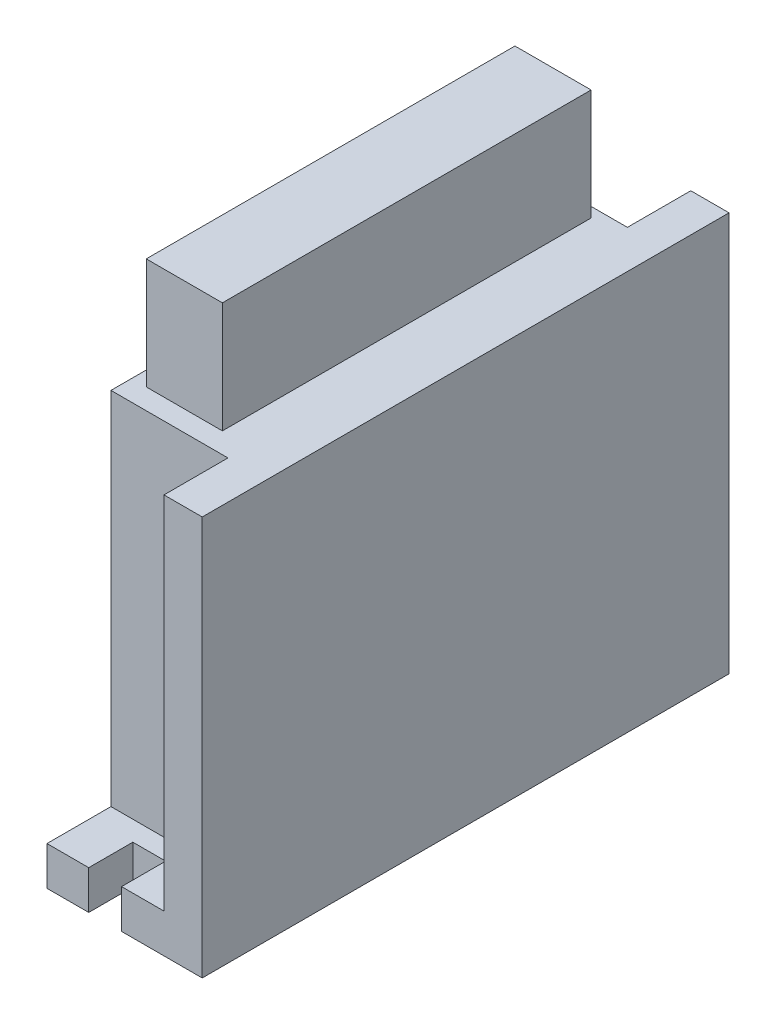
ISO-10303-21;
HEADER;
FILE_DESCRIPTION(('STEP AP214'),'2;1');
FILE_NAME('part.step','',(''),(''),'','','');
FILE_SCHEMA(('AUTOMOTIVE_DESIGN { 1 0 10303 214 1 1 1 1 }'));
ENDSEC;
DATA;
#1=APPLICATION_CONTEXT('core data for automotive mechanical design processes');
#2=APPLICATION_PROTOCOL_DEFINITION('international standard','automotive_design',2000,#1);
#3=PRODUCT_CONTEXT('',#1,'mechanical');
#4=PRODUCT('Part','Part','',(#3));
#5=PRODUCT_RELATED_PRODUCT_CATEGORY('part','',(#4));
#6=PRODUCT_DEFINITION_FORMATION('','',#4);
#7=PRODUCT_DEFINITION_CONTEXT('part definition',#1,'design');
#8=PRODUCT_DEFINITION('design','',#6,#7);
#9=PRODUCT_DEFINITION_SHAPE('','',#8);
#10=(LENGTH_UNIT() NAMED_UNIT(*) SI_UNIT(.MILLI.,.METRE.));
#11=(NAMED_UNIT(*) PLANE_ANGLE_UNIT() SI_UNIT($,.RADIAN.));
#12=(NAMED_UNIT(*) SI_UNIT($,.STERADIAN.) SOLID_ANGLE_UNIT());
#13=UNCERTAINTY_MEASURE_WITH_UNIT(LENGTH_MEASURE(1.E-05),#10,'distance_accuracy_value','');
#14=(GEOMETRIC_REPRESENTATION_CONTEXT(3) GLOBAL_UNCERTAINTY_ASSIGNED_CONTEXT((#13)) GLOBAL_UNIT_ASSIGNED_CONTEXT((#10,
#11,#12)) REPRESENTATION_CONTEXT('',''));
#15=CARTESIAN_POINT('',(0.,0.,0.));
#16=DIRECTION('',(0.,0.,1.));
#17=DIRECTION('',(1.,0.,0.));
#18=AXIS2_PLACEMENT_3D('',#15,#16,#17);
#19=CARTESIAN_POINT('',(-8.85412667946256,72.,51.3291746641075));
#20=DIRECTION('',(0.,0.,-1.));
#21=DIRECTION('',(-1.,0.,0.));
#22=AXIS2_PLACEMENT_3D('',#19,#20,#21);
#23=PLANE('',#22);
#24=DIRECTION('',(1.,0.,0.));
#25=VECTOR('',#24,1.);
#26=CARTESIAN_POINT('',(-8.85412667946256,0.,51.3291746641075));
#27=LINE('',#26,#25);
#28=CARTESIAN_POINT('',(-8.85412667946256,0.,51.3291746641075));
#29=VERTEX_POINT('',#28);
#30=CARTESIAN_POINT('',(-1.3231264849736,0.,51.3291746641075));
#31=VERTEX_POINT('',#30);
#32=EDGE_CURVE('E215',#29,#31,#27,.T.);
#33=ORIENTED_EDGE('',*,*,#32,.T.);
#34=DIRECTION('',(0.,1.,0.));
#35=VECTOR('',#34,1.);
#36=CARTESIAN_POINT('',(-1.3231264849736,-58.,51.3291746641075));
#37=LINE('',#36,#35);
#38=CARTESIAN_POINT('',(-1.3231264849736,6.99999999999998,51.3291746641075));
#39=VERTEX_POINT('',#38);
#40=EDGE_CURVE('E198',#31,#39,#37,.T.);
#41=ORIENTED_EDGE('',*,*,#40,.T.);
#42=DIRECTION('',(1.,0.,0.));
#43=VECTOR('',#42,1.);
#44=CARTESIAN_POINT('',(-8.85412667946256,6.99999999999998,51.3291746641075));
#45=LINE('',#44,#43);
#46=CARTESIAN_POINT('',(-8.85412667946256,6.99999999999998,51.3291746641075));
#47=VERTEX_POINT('',#46);
#48=EDGE_CURVE('E212',#47,#39,#45,.T.);
#49=ORIENTED_EDGE('',*,*,#48,.F.);
#50=DIRECTION('',(0.,-1.,0.));
#51=VECTOR('',#50,1.);
#52=CARTESIAN_POINT('',(-8.85412667946256,72.,51.3291746641075));
#53=LINE('',#52,#51);
#54=EDGE_CURVE('E11',#47,#29,#53,.T.);
#55=ORIENTED_EDGE('',*,*,#54,.T.);
#56=EDGE_LOOP('',(#33,#41,#49,#55));
#57=FACE_BOUND('',#56,.T.);
#58=ADVANCED_FACE('F45',(#57),#23,.F.);
#59=CARTESIAN_POINT('',(-8.85412667946257,72.,-43.6708253358925));
#60=DIRECTION('',(0.,0.,1.));
#61=DIRECTION('',(1.,0.,0.));
#62=AXIS2_PLACEMENT_3D('',#59,#60,#61);
#63=PLANE('',#62);
#64=DIRECTION('',(-1.,0.,0.));
#65=VECTOR('',#64,1.);
#66=CARTESIAN_POINT('',(-8.85412667946257,6.99999999999998,-43.6708253358925));
#67=LINE('',#66,#65);
#68=CARTESIAN_POINT('',(-1.3231264849736,6.99999999999998,-43.6708253358925));
#69=VERTEX_POINT('',#68);
#70=CARTESIAN_POINT('',(-8.85412667946257,6.99999999999998,-43.6708253358925));
#71=VERTEX_POINT('',#70);
#72=EDGE_CURVE('E259',#69,#71,#67,.T.);
#73=ORIENTED_EDGE('',*,*,#72,.F.);
#74=DIRECTION('',(0.,1.,0.));
#75=VECTOR('',#74,1.);
#76=CARTESIAN_POINT('',(-1.3231264849736,-58.,-43.6708253358925));
#77=LINE('',#76,#75);
#78=CARTESIAN_POINT('',(-1.3231264849736,0.,-43.6708253358925));
#79=VERTEX_POINT('',#78);
#80=EDGE_CURVE('E423',#79,#69,#77,.T.);
#81=ORIENTED_EDGE('',*,*,#80,.F.);
#82=DIRECTION('',(-1.,0.,0.));
#83=VECTOR('',#82,1.);
#84=CARTESIAN_POINT('',(-8.85412667946257,0.,-43.6708253358925));
#85=LINE('',#84,#83);
#86=CARTESIAN_POINT('',(-8.85412667946257,0.,-43.6708253358925));
#87=VERTEX_POINT('',#86);
#88=EDGE_CURVE('E357',#79,#87,#85,.T.);
#89=ORIENTED_EDGE('',*,*,#88,.T.);
#90=DIRECTION('',(0.,-1.,0.));
#91=VECTOR('',#90,1.);
#92=CARTESIAN_POINT('',(-8.85412667946257,72.,-43.6708253358925));
#93=LINE('',#92,#91);
#94=EDGE_CURVE('E347',#71,#87,#93,.T.);
#95=ORIENTED_EDGE('',*,*,#94,.F.);
#96=EDGE_LOOP('',(#73,#81,#89,#95));
#97=FACE_BOUND('',#96,.T.);
#98=ADVANCED_FACE('F420',(#97),#63,.F.);
#99=CARTESIAN_POINT('',(-8.85412667946257,72.,-43.6708253358925));
#100=DIRECTION('',(1.,0.,0.));
#101=DIRECTION('',(0.,0.,-1.));
#102=AXIS2_PLACEMENT_3D('',#99,#100,#101);
#103=PLANE('',#102);
#104=DIRECTION('',(0.,0.,1.));
#105=VECTOR('',#104,1.);
#106=CARTESIAN_POINT('',(-8.85412667946256,6.99999999999998,51.3291746641075));
#107=LINE('',#106,#105);
#108=CARTESIAN_POINT('',(-8.85412667946256,6.99999999999998,39.789202994742));
#109=VERTEX_POINT('',#108);
#110=EDGE_CURVE('E222',#109,#47,#107,.T.);
#111=ORIENTED_EDGE('',*,*,#110,.F.);
#112=DIRECTION('',(0.,1.,0.));
#113=VECTOR('',#112,1.);
#114=CARTESIAN_POINT('',(-8.85412667946256,6.99999999999998,39.789202994742));
#115=LINE('',#114,#113);
#116=CARTESIAN_POINT('',(-8.85412667946256,72.,39.789202994742));
#117=VERTEX_POINT('',#116);
#118=EDGE_CURVE('E246',#109,#117,#115,.T.);
#119=ORIENTED_EDGE('',*,*,#118,.T.);
#120=DIRECTION('',(0.,0.,1.));
#121=VECTOR('',#120,1.);
#122=CARTESIAN_POINT('',(-8.85412667946257,72.,-43.6708253358925));
#123=LINE('',#122,#121);
#124=CARTESIAN_POINT('',(-8.85412667946257,72.,-32.2364925855632));
#125=VERTEX_POINT('',#124);
#126=EDGE_CURVE('E332',#125,#117,#123,.T.);
#127=ORIENTED_EDGE('',*,*,#126,.F.);
#128=DIRECTION('',(0.,1.,0.));
#129=VECTOR('',#128,1.);
#130=CARTESIAN_POINT('',(-8.85412667946257,6.99999999999998,-32.2364925855632));
#131=LINE('',#130,#129);
#132=CARTESIAN_POINT('',(-8.85412667946257,6.99999999999998,-32.2364925855632));
#133=VERTEX_POINT('',#132);
#134=EDGE_CURVE('E256',#133,#125,#131,.T.);
#135=ORIENTED_EDGE('',*,*,#134,.F.);
#136=DIRECTION('',(0.,0.,1.));
#137=VECTOR('',#136,1.);
#138=CARTESIAN_POINT('',(-8.85412667946257,6.99999999999998,-43.6708253358925));
#139=LINE('',#138,#137);
#140=EDGE_CURVE('E271',#71,#133,#139,.T.);
#141=ORIENTED_EDGE('',*,*,#140,.F.);
#142=ORIENTED_EDGE('',*,*,#94,.T.);
#143=DIRECTION('',(0.,0.,1.));
#144=VECTOR('',#143,1.);
#145=CARTESIAN_POINT('',(-8.85412667946257,0.,-43.6708253358925));
#146=LINE('',#145,#144);
#147=EDGE_CURVE('E331',#87,#29,#146,.T.);
#148=ORIENTED_EDGE('',*,*,#147,.T.);
#149=ORIENTED_EDGE('',*,*,#54,.F.);
#150=EDGE_LOOP('',(#111,#119,#127,#135,#141,#142,#148,#149));
#151=FACE_BOUND('',#150,.T.);
#152=ADVANCED_FACE('F47',(#151),#103,.F.);
#153=CARTESIAN_POINT('',(4.59791098407061,6.99999999999998,51.3291746641075));
#154=VERTEX_POINT('',#153);
#155=CARTESIAN_POINT('',(12.2490887932554,6.99999999999998,51.3291746641075));
#156=VERTEX_POINT('',#155);
#157=EDGE_CURVE('E225',#154,#156,#45,.T.);
#158=ORIENTED_EDGE('',*,*,#157,.F.);
#159=DIRECTION('',(0.,1.,0.));
#160=VECTOR('',#159,1.);
#161=CARTESIAN_POINT('',(4.59791098407061,-58.,51.3291746641075));
#162=LINE('',#161,#160);
#163=CARTESIAN_POINT('',(4.59791098407061,0.,51.3291746641075));
#164=VERTEX_POINT('',#163);
#165=EDGE_CURVE('E69',#164,#154,#162,.T.);
#166=ORIENTED_EDGE('',*,*,#165,.F.);
#167=CARTESIAN_POINT('',(19.1458733205374,0.,51.3291746641075));
#168=VERTEX_POINT('',#167);
#169=EDGE_CURVE('E351',#164,#168,#27,.T.);
#170=ORIENTED_EDGE('',*,*,#169,.T.);
#171=DIRECTION('',(0.,-1.,0.));
#172=VECTOR('',#171,1.);
#173=CARTESIAN_POINT('',(19.1458733205374,72.,51.3291746641075));
#174=LINE('',#173,#172);
#175=CARTESIAN_POINT('',(19.1458733205374,72.,51.3291746641075));
#176=VERTEX_POINT('',#175);
#177=EDGE_CURVE('E54',#176,#168,#174,.T.);
#178=ORIENTED_EDGE('',*,*,#177,.F.);
#179=DIRECTION('',(1.,0.,0.));
#180=VECTOR('',#179,1.);
#181=CARTESIAN_POINT('',(-8.85412667946256,72.,51.3291746641075));
#182=LINE('',#181,#180);
#183=CARTESIAN_POINT('',(12.2490887932554,72.,51.3291746641075));
#184=VERTEX_POINT('',#183);
#185=EDGE_CURVE('E336',#184,#176,#182,.T.);
#186=ORIENTED_EDGE('',*,*,#185,.F.);
#187=DIRECTION('',(0.,1.,0.));
#188=VECTOR('',#187,1.);
#189=CARTESIAN_POINT('',(12.2490887932554,6.99999999999998,51.3291746641075));
#190=LINE('',#189,#188);
#191=EDGE_CURVE('E237',#156,#184,#190,.T.);
#192=ORIENTED_EDGE('',*,*,#191,.F.);
#193=EDGE_LOOP('',(#158,#166,#170,#178,#186,#192));
#194=FACE_BOUND('',#193,.T.);
#195=ADVANCED_FACE('F401',(#194),#23,.F.);
#196=CARTESIAN_POINT('',(19.1458733205374,72.,-43.6708253358925));
#197=DIRECTION('',(-1.,0.,0.));
#198=DIRECTION('',(0.,0.,1.));
#199=AXIS2_PLACEMENT_3D('',#196,#197,#198);
#200=PLANE('',#199);
#201=DIRECTION('',(0.,0.,-1.));
#202=VECTOR('',#201,1.);
#203=CARTESIAN_POINT('',(19.1458733205374,0.,-43.6708253358925));
#204=LINE('',#203,#202);
#205=CARTESIAN_POINT('',(19.1458733205374,0.,-43.6708253358925));
#206=VERTEX_POINT('',#205);
#207=EDGE_CURVE('E354',#168,#206,#204,.T.);
#208=ORIENTED_EDGE('',*,*,#207,.T.);
#209=DIRECTION('',(0.,-1.,0.));
#210=VECTOR('',#209,1.);
#211=CARTESIAN_POINT('',(19.1458733205374,72.,-43.6708253358925));
#212=LINE('',#211,#210);
#213=CARTESIAN_POINT('',(19.1458733205374,72.,-43.6708253358925));
#214=VERTEX_POINT('',#213);
#215=EDGE_CURVE('E364',#214,#206,#212,.T.);
#216=ORIENTED_EDGE('',*,*,#215,.F.);
#217=DIRECTION('',(0.,0.,-1.));
#218=VECTOR('',#217,1.);
#219=CARTESIAN_POINT('',(19.1458733205374,72.,-43.6708253358925));
#220=LINE('',#219,#218);
#221=EDGE_CURVE('E340',#176,#214,#220,.T.);
#222=ORIENTED_EDGE('',*,*,#221,.F.);
#223=ORIENTED_EDGE('',*,*,#177,.T.);
#224=EDGE_LOOP('',(#208,#216,#222,#223));
#225=FACE_BOUND('',#224,.T.);
#226=ADVANCED_FACE('F373',(#225),#200,.F.);
#227=CARTESIAN_POINT('',(4.59791098407061,0.,-43.6708253358925));
#228=VERTEX_POINT('',#227);
#229=EDGE_CURVE('E337',#206,#228,#85,.T.);
#230=ORIENTED_EDGE('',*,*,#229,.T.);
#231=DIRECTION('',(0.,1.,0.));
#232=VECTOR('',#231,1.);
#233=CARTESIAN_POINT('',(4.59791098407061,-58.,-43.6708253358925));
#234=LINE('',#233,#232);
#235=CARTESIAN_POINT('',(4.59791098407061,6.99999999999998,-43.6708253358925));
#236=VERTEX_POINT('',#235);
#237=EDGE_CURVE('E390',#228,#236,#234,.T.);
#238=ORIENTED_EDGE('',*,*,#237,.T.);
#239=CARTESIAN_POINT('',(12.2490887932554,6.99999999999998,-43.6708253358925));
#240=VERTEX_POINT('',#239);
#241=EDGE_CURVE('E275',#240,#236,#67,.T.);
#242=ORIENTED_EDGE('',*,*,#241,.F.);
#243=DIRECTION('',(0.,1.,0.));
#244=VECTOR('',#243,1.);
#245=CARTESIAN_POINT('',(12.2490887932554,6.99999999999998,-43.6708253358925));
#246=LINE('',#245,#244);
#247=CARTESIAN_POINT('',(12.2490887932554,72.,-43.6708253358925));
#248=VERTEX_POINT('',#247);
#249=EDGE_CURVE('E263',#240,#248,#246,.T.);
#250=ORIENTED_EDGE('',*,*,#249,.T.);
#251=DIRECTION('',(-1.,0.,0.));
#252=VECTOR('',#251,1.);
#253=CARTESIAN_POINT('',(-8.85412667946257,72.,-43.6708253358925));
#254=LINE('',#253,#252);
#255=EDGE_CURVE('E343',#214,#248,#254,.T.);
#256=ORIENTED_EDGE('',*,*,#255,.F.);
#257=ORIENTED_EDGE('',*,*,#215,.T.);
#258=EDGE_LOOP('',(#230,#238,#242,#250,#256,#257));
#259=FACE_BOUND('',#258,.T.);
#260=ADVANCED_FACE('F388',(#259),#63,.F.);
#261=CARTESIAN_POINT('',(0.,72.,0.));
#262=DIRECTION('',(0.,1.,0.));
#263=DIRECTION('',(0.,0.,1.));
#264=AXIS2_PLACEMENT_3D('',#261,#262,#263);
#265=PLANE('',#264);
#266=DIRECTION('',(-1.,0.,0.));
#267=VECTOR('',#266,1.);
#268=CARTESIAN_POINT('',(-8.85412667946256,72.,39.789202994742));
#269=LINE('',#268,#267);
#270=CARTESIAN_POINT('',(12.2490887932554,72.,39.789202994742));
#271=VERTEX_POINT('',#270);
#272=EDGE_CURVE('E242',#271,#117,#269,.T.);
#273=ORIENTED_EDGE('',*,*,#272,.F.);
#274=DIRECTION('',(0.,0.,-1.));
#275=VECTOR('',#274,1.);
#276=CARTESIAN_POINT('',(12.2490887932554,72.,51.3291746641075));
#277=LINE('',#276,#275);
#278=EDGE_CURVE('E238',#184,#271,#277,.T.);
#279=ORIENTED_EDGE('',*,*,#278,.F.);
#280=ORIENTED_EDGE('',*,*,#185,.T.);
#281=ORIENTED_EDGE('',*,*,#221,.T.);
#282=ORIENTED_EDGE('',*,*,#255,.T.);
#283=DIRECTION('',(0.,0.,-1.));
#284=VECTOR('',#283,1.);
#285=CARTESIAN_POINT('',(12.2490887932554,72.,-43.6708253358925));
#286=LINE('',#285,#284);
#287=CARTESIAN_POINT('',(12.2490887932554,72.,-32.2364925855632));
#288=VERTEX_POINT('',#287);
#289=EDGE_CURVE('E268',#288,#248,#286,.T.);
#290=ORIENTED_EDGE('',*,*,#289,.F.);
#291=DIRECTION('',(1.,0.,0.));
#292=VECTOR('',#291,1.);
#293=CARTESIAN_POINT('',(-8.85412667946257,72.,-32.2364925855632));
#294=LINE('',#293,#292);
#295=EDGE_CURVE('E243',#125,#288,#294,.T.);
#296=ORIENTED_EDGE('',*,*,#295,.F.);
#297=ORIENTED_EDGE('',*,*,#126,.T.);
#298=EDGE_LOOP('',(#273,#279,#280,#281,#282,#290,#296,#297));
#299=FACE_BOUND('',#298,.T.);
#300=DIRECTION('',(1.,0.,0.));
#301=VECTOR('',#300,1.);
#302=CARTESIAN_POINT('',(-6.21023981329054,72.,36.0676254595715));
#303=LINE('',#302,#301);
#304=CARTESIAN_POINT('',(-6.21023981329054,72.,36.0676254595715));
#305=VERTEX_POINT('',#304);
#306=CARTESIAN_POINT('',(7.52037677856033,72.,36.0676254595715));
#307=VERTEX_POINT('',#306);
#308=EDGE_CURVE('E250',#305,#307,#303,.T.);
#309=ORIENTED_EDGE('',*,*,#308,.F.);
#310=DIRECTION('',(0.,0.,1.));
#311=VECTOR('',#310,1.);
#312=CARTESIAN_POINT('',(-6.21023981329055,72.,-30.4184713650687));
#313=LINE('',#312,#311);
#314=CARTESIAN_POINT('',(-6.21023981329055,72.,-30.4184713650687));
#315=VERTEX_POINT('',#314);
#316=EDGE_CURVE('E294',#315,#305,#313,.T.);
#317=ORIENTED_EDGE('',*,*,#316,.F.);
#318=DIRECTION('',(1.,0.,0.));
#319=VECTOR('',#318,1.);
#320=CARTESIAN_POINT('',(-6.21023981329055,72.,-30.4184713650687));
#321=LINE('',#320,#319);
#322=CARTESIAN_POINT('',(7.52037677856032,72.,-30.4184713650687));
#323=VERTEX_POINT('',#322);
#324=EDGE_CURVE('E312',#315,#323,#321,.T.);
#325=ORIENTED_EDGE('',*,*,#324,.T.);
#326=DIRECTION('',(0.,0.,1.));
#327=VECTOR('',#326,1.);
#328=CARTESIAN_POINT('',(7.52037677856032,72.,-30.4184713650687));
#329=LINE('',#328,#327);
#330=EDGE_CURVE('E308',#323,#307,#329,.T.);
#331=ORIENTED_EDGE('',*,*,#330,.T.);
#332=EDGE_LOOP('',(#309,#317,#325,#331));
#333=FACE_BOUND('',#332,.T.);
#334=ADVANCED_FACE('F395',(#299,#333),#265,.T.);
#335=CARTESIAN_POINT('',(0.,0.,0.));
#336=DIRECTION('',(0.,1.,0.));
#337=DIRECTION('',(0.,0.,1.));
#338=AXIS2_PLACEMENT_3D('',#335,#336,#337);
#339=PLANE('',#338);
#340=DIRECTION('',(-1.,0.,0.));
#341=VECTOR('',#340,1.);
#342=CARTESIAN_POINT('',(0.,0.,43.3737899457962));
#343=LINE('',#342,#341);
#344=CARTESIAN_POINT('',(4.59791098407061,0.,43.3737899457962));
#345=VERTEX_POINT('',#344);
#346=CARTESIAN_POINT('',(-1.3231264849736,0.,43.3737899457962));
#347=VERTEX_POINT('',#346);
#348=EDGE_CURVE('E456',#345,#347,#343,.T.);
#349=ORIENTED_EDGE('',*,*,#348,.T.);
#350=DIRECTION('',(0.,0.,1.));
#351=VECTOR('',#350,1.);
#352=CARTESIAN_POINT('',(-1.3231264849736,0.,0.));
#353=LINE('',#352,#351);
#354=EDGE_CURVE('E459',#347,#31,#353,.T.);
#355=ORIENTED_EDGE('',*,*,#354,.T.);
#356=ORIENTED_EDGE('',*,*,#32,.F.);
#357=ORIENTED_EDGE('',*,*,#147,.F.);
#358=ORIENTED_EDGE('',*,*,#88,.F.);
#359=DIRECTION('',(0.,0.,1.));
#360=VECTOR('',#359,1.);
#361=CARTESIAN_POINT('',(-1.3231264849736,0.,0.));
#362=LINE('',#361,#360);
#363=CARTESIAN_POINT('',(-1.3231264849736,0.,-35.7154406175813));
#364=VERTEX_POINT('',#363);
#365=EDGE_CURVE('E267',#79,#364,#362,.T.);
#366=ORIENTED_EDGE('',*,*,#365,.T.);
#367=DIRECTION('',(1.,0.,0.));
#368=VECTOR('',#367,1.);
#369=CARTESIAN_POINT('',(0.,0.,-35.7154406175813));
#370=LINE('',#369,#368);
#371=CARTESIAN_POINT('',(4.59791098407061,0.,-35.7154406175813));
#372=VERTEX_POINT('',#371);
#373=EDGE_CURVE('E462',#364,#372,#370,.T.);
#374=ORIENTED_EDGE('',*,*,#373,.T.);
#375=DIRECTION('',(0.,0.,-1.));
#376=VECTOR('',#375,1.);
#377=CARTESIAN_POINT('',(4.59791098407061,0.,0.));
#378=LINE('',#377,#376);
#379=EDGE_CURVE('E385',#372,#228,#378,.T.);
#380=ORIENTED_EDGE('',*,*,#379,.T.);
#381=ORIENTED_EDGE('',*,*,#229,.F.);
#382=ORIENTED_EDGE('',*,*,#207,.F.);
#383=ORIENTED_EDGE('',*,*,#169,.F.);
#384=DIRECTION('',(0.,0.,-1.));
#385=VECTOR('',#384,1.);
#386=CARTESIAN_POINT('',(4.59791098407061,0.,0.));
#387=LINE('',#386,#385);
#388=EDGE_CURVE('E453',#164,#345,#387,.T.);
#389=ORIENTED_EDGE('',*,*,#388,.T.);
#390=EDGE_LOOP('',(#349,#355,#356,#357,#358,#366,#374,#380,#381,#382,#383,#389));
#391=FACE_BOUND('',#390,.T.);
#392=ADVANCED_FACE('F381',(#391),#339,.F.);
#393=CARTESIAN_POINT('',(-6.21023981329054,92.,36.0676254595715));
#394=DIRECTION('',(0.,0.,-1.));
#395=DIRECTION('',(-1.,0.,0.));
#396=AXIS2_PLACEMENT_3D('',#393,#394,#395);
#397=PLANE('',#396);
#398=ORIENTED_EDGE('',*,*,#308,.T.);
#399=DIRECTION('',(0.,-1.,0.));
#400=VECTOR('',#399,1.);
#401=CARTESIAN_POINT('',(7.52037677856033,92.,36.0676254595715));
#402=LINE('',#401,#400);
#403=CARTESIAN_POINT('',(7.52037677856033,92.,36.0676254595715));
#404=VERTEX_POINT('',#403);
#405=EDGE_CURVE('E327',#404,#307,#402,.T.);
#406=ORIENTED_EDGE('',*,*,#405,.F.);
#407=DIRECTION('',(1.,0.,0.));
#408=VECTOR('',#407,1.);
#409=CARTESIAN_POINT('',(-6.21023981329054,92.,36.0676254595715));
#410=LINE('',#409,#408);
#411=CARTESIAN_POINT('',(-6.21023981329054,92.,36.0676254595715));
#412=VERTEX_POINT('',#411);
#413=EDGE_CURVE('E290',#412,#404,#410,.T.);
#414=ORIENTED_EDGE('',*,*,#413,.F.);
#415=DIRECTION('',(0.,-1.,0.));
#416=VECTOR('',#415,1.);
#417=CARTESIAN_POINT('',(-6.21023981329054,92.,36.0676254595715));
#418=LINE('',#417,#416);
#419=EDGE_CURVE('E305',#412,#305,#418,.T.);
#420=ORIENTED_EDGE('',*,*,#419,.T.);
#421=EDGE_LOOP('',(#398,#406,#414,#420));
#422=FACE_BOUND('',#421,.T.);
#423=ADVANCED_FACE('F622',(#422),#397,.F.);
#424=CARTESIAN_POINT('',(7.52037677856032,92.,-30.4184713650687));
#425=DIRECTION('',(1.,0.,0.));
#426=DIRECTION('',(0.,0.,-1.));
#427=AXIS2_PLACEMENT_3D('',#424,#425,#426);
#428=PLANE('',#427);
#429=ORIENTED_EDGE('',*,*,#330,.F.);
#430=DIRECTION('',(0.,-1.,0.));
#431=VECTOR('',#430,1.);
#432=CARTESIAN_POINT('',(7.52037677856032,92.,-30.4184713650687));
#433=LINE('',#432,#431);
#434=CARTESIAN_POINT('',(7.52037677856032,92.,-30.4184713650687));
#435=VERTEX_POINT('',#434);
#436=EDGE_CURVE('E324',#435,#323,#433,.T.);
#437=ORIENTED_EDGE('',*,*,#436,.F.);
#438=DIRECTION('',(0.,0.,1.));
#439=VECTOR('',#438,1.);
#440=CARTESIAN_POINT('',(7.52037677856032,92.,-30.4184713650687));
#441=LINE('',#440,#439);
#442=EDGE_CURVE('E293',#435,#404,#441,.T.);
#443=ORIENTED_EDGE('',*,*,#442,.T.);
#444=ORIENTED_EDGE('',*,*,#405,.T.);
#445=EDGE_LOOP('',(#429,#437,#443,#444));
#446=FACE_BOUND('',#445,.T.);
#447=ADVANCED_FACE('F647',(#446),#428,.T.);
#448=CARTESIAN_POINT('',(-6.21023981329055,92.,-30.4184713650687));
#449=DIRECTION('',(0.,0.,-1.));
#450=DIRECTION('',(-1.,0.,0.));
#451=AXIS2_PLACEMENT_3D('',#448,#449,#450);
#452=PLANE('',#451);
#453=ORIENTED_EDGE('',*,*,#324,.F.);
#454=DIRECTION('',(0.,-1.,0.));
#455=VECTOR('',#454,1.);
#456=CARTESIAN_POINT('',(-6.21023981329055,92.,-30.4184713650687));
#457=LINE('',#456,#455);
#458=CARTESIAN_POINT('',(-6.21023981329055,92.,-30.4184713650687));
#459=VERTEX_POINT('',#458);
#460=EDGE_CURVE('E321',#459,#315,#457,.T.);
#461=ORIENTED_EDGE('',*,*,#460,.F.);
#462=DIRECTION('',(1.,0.,0.));
#463=VECTOR('',#462,1.);
#464=CARTESIAN_POINT('',(-6.21023981329055,92.,-30.4184713650687));
#465=LINE('',#464,#463);
#466=EDGE_CURVE('E298',#459,#435,#465,.T.);
#467=ORIENTED_EDGE('',*,*,#466,.T.);
#468=ORIENTED_EDGE('',*,*,#436,.T.);
#469=EDGE_LOOP('',(#453,#461,#467,#468));
#470=FACE_BOUND('',#469,.T.);
#471=ADVANCED_FACE('F656',(#470),#452,.T.);
#472=CARTESIAN_POINT('',(-6.21023981329055,92.,-30.4184713650687));
#473=DIRECTION('',(1.,0.,0.));
#474=DIRECTION('',(0.,0.,-1.));
#475=AXIS2_PLACEMENT_3D('',#472,#473,#474);
#476=PLANE('',#475);
#477=ORIENTED_EDGE('',*,*,#316,.T.);
#478=ORIENTED_EDGE('',*,*,#419,.F.);
#479=DIRECTION('',(0.,0.,1.));
#480=VECTOR('',#479,1.);
#481=CARTESIAN_POINT('',(-6.21023981329055,92.,-30.4184713650687));
#482=LINE('',#481,#480);
#483=EDGE_CURVE('E302',#459,#412,#482,.T.);
#484=ORIENTED_EDGE('',*,*,#483,.F.);
#485=ORIENTED_EDGE('',*,*,#460,.T.);
#486=EDGE_LOOP('',(#477,#478,#484,#485));
#487=FACE_BOUND('',#486,.T.);
#488=ADVANCED_FACE('F664',(#487),#476,.F.);
#489=CARTESIAN_POINT('',(0.,92.,0.));
#490=DIRECTION('',(0.,-1.,0.));
#491=DIRECTION('',(0.,0.,-1.));
#492=AXIS2_PLACEMENT_3D('',#489,#490,#491);
#493=PLANE('',#492);
#494=ORIENTED_EDGE('',*,*,#413,.T.);
#495=ORIENTED_EDGE('',*,*,#442,.F.);
#496=ORIENTED_EDGE('',*,*,#466,.F.);
#497=ORIENTED_EDGE('',*,*,#483,.T.);
#498=EDGE_LOOP('',(#494,#495,#496,#497));
#499=FACE_BOUND('',#498,.T.);
#500=ADVANCED_FACE('F506',(#499),#493,.F.);
#501=CARTESIAN_POINT('',(12.2490887932554,6.99999999999998,-43.6708253358925));
#502=DIRECTION('',(1.,0.,0.));
#503=DIRECTION('',(0.,0.,-1.));
#504=AXIS2_PLACEMENT_3D('',#501,#502,#503);
#505=PLANE('',#504);
#506=ORIENTED_EDGE('',*,*,#289,.T.);
#507=ORIENTED_EDGE('',*,*,#249,.F.);
#508=DIRECTION('',(0.,0.,-1.));
#509=VECTOR('',#508,1.);
#510=CARTESIAN_POINT('',(12.2490887932554,6.99999999999998,-43.6708253358925));
#511=LINE('',#510,#509);
#512=CARTESIAN_POINT('',(12.2490887932554,6.99999999999998,-32.2364925855632));
#513=VERTEX_POINT('',#512);
#514=EDGE_CURVE('E279',#513,#240,#511,.T.);
#515=ORIENTED_EDGE('',*,*,#514,.F.);
#516=DIRECTION('',(0.,1.,0.));
#517=VECTOR('',#516,1.);
#518=CARTESIAN_POINT('',(12.2490887932554,6.99999999999998,-32.2364925855632));
#519=LINE('',#518,#517);
#520=EDGE_CURVE('E260',#513,#288,#519,.T.);
#521=ORIENTED_EDGE('',*,*,#520,.T.);
#522=EDGE_LOOP('',(#506,#507,#515,#521));
#523=FACE_BOUND('',#522,.T.);
#524=ADVANCED_FACE('F519',(#523),#505,.F.);
#525=CARTESIAN_POINT('',(-8.85412667946257,6.99999999999998,-32.2364925855632));
#526=DIRECTION('',(0.,0.,1.));
#527=DIRECTION('',(1.,0.,0.));
#528=AXIS2_PLACEMENT_3D('',#525,#526,#527);
#529=PLANE('',#528);
#530=ORIENTED_EDGE('',*,*,#295,.T.);
#531=ORIENTED_EDGE('',*,*,#520,.F.);
#532=DIRECTION('',(1.,0.,0.));
#533=VECTOR('',#532,1.);
#534=CARTESIAN_POINT('',(-8.85412667946257,6.99999999999998,-32.2364925855632));
#535=LINE('',#534,#533);
#536=EDGE_CURVE('E283',#133,#513,#535,.T.);
#537=ORIENTED_EDGE('',*,*,#536,.F.);
#538=ORIENTED_EDGE('',*,*,#134,.T.);
#539=EDGE_LOOP('',(#530,#531,#537,#538));
#540=FACE_BOUND('',#539,.T.);
#541=ADVANCED_FACE('F412',(#540),#529,.F.);
#542=CARTESIAN_POINT('',(0.,6.99999999999998,0.));
#543=DIRECTION('',(0.,1.,0.));
#544=DIRECTION('',(0.,0.,1.));
#545=AXIS2_PLACEMENT_3D('',#542,#543,#544);
#546=PLANE('',#545);
#547=DIRECTION('',(0.,0.,1.));
#548=VECTOR('',#547,1.);
#549=CARTESIAN_POINT('',(-1.3231264849736,6.99999999999998,-43.6708253358925));
#550=LINE('',#549,#548);
#551=CARTESIAN_POINT('',(-1.3231264849736,6.99999999999998,-35.7154406175813));
#552=VERTEX_POINT('',#551);
#553=EDGE_CURVE('E61',#69,#552,#550,.T.);
#554=ORIENTED_EDGE('',*,*,#553,.F.);
#555=ORIENTED_EDGE('',*,*,#72,.T.);
#556=ORIENTED_EDGE('',*,*,#140,.T.);
#557=ORIENTED_EDGE('',*,*,#536,.T.);
#558=ORIENTED_EDGE('',*,*,#514,.T.);
#559=ORIENTED_EDGE('',*,*,#241,.T.);
#560=DIRECTION('',(0.,0.,-1.));
#561=VECTOR('',#560,1.);
#562=CARTESIAN_POINT('',(4.59791098407061,6.99999999999998,-43.6708253358925));
#563=LINE('',#562,#561);
#564=CARTESIAN_POINT('',(4.59791098407061,6.99999999999998,-35.7154406175813));
#565=VERTEX_POINT('',#564);
#566=EDGE_CURVE('E437',#565,#236,#563,.T.);
#567=ORIENTED_EDGE('',*,*,#566,.F.);
#568=DIRECTION('',(1.,0.,0.));
#569=VECTOR('',#568,1.);
#570=CARTESIAN_POINT('',(-1.3231264849736,6.99999999999998,-35.7154406175813));
#571=LINE('',#570,#569);
#572=EDGE_CURVE('E447',#552,#565,#571,.T.);
#573=ORIENTED_EDGE('',*,*,#572,.F.);
#574=EDGE_LOOP('',(#554,#555,#556,#557,#558,#559,#567,#573));
#575=FACE_BOUND('',#574,.T.);
#576=ADVANCED_FACE('F473',(#575),#546,.T.);
#577=CARTESIAN_POINT('',(-8.85412667946256,6.99999999999998,39.789202994742));
#578=DIRECTION('',(0.,0.,-1.));
#579=DIRECTION('',(-1.,0.,0.));
#580=AXIS2_PLACEMENT_3D('',#577,#578,#579);
#581=PLANE('',#580);
#582=ORIENTED_EDGE('',*,*,#272,.T.);
#583=ORIENTED_EDGE('',*,*,#118,.F.);
#584=DIRECTION('',(-1.,0.,0.));
#585=VECTOR('',#584,1.);
#586=CARTESIAN_POINT('',(-8.85412667946256,6.99999999999998,39.789202994742));
#587=LINE('',#586,#585);
#588=CARTESIAN_POINT('',(12.2490887932554,6.99999999999998,39.789202994742));
#589=VERTEX_POINT('',#588);
#590=EDGE_CURVE('E230',#589,#109,#587,.T.);
#591=ORIENTED_EDGE('',*,*,#590,.F.);
#592=DIRECTION('',(0.,1.,0.));
#593=VECTOR('',#592,1.);
#594=CARTESIAN_POINT('',(12.2490887932554,6.99999999999998,39.789202994742));
#595=LINE('',#594,#593);
#596=EDGE_CURVE('E251',#589,#271,#595,.T.);
#597=ORIENTED_EDGE('',*,*,#596,.T.);
#598=EDGE_LOOP('',(#582,#583,#591,#597));
#599=FACE_BOUND('',#598,.T.);
#600=ADVANCED_FACE('F407',(#599),#581,.F.);
#601=CARTESIAN_POINT('',(12.2490887932554,6.99999999999998,51.3291746641075));
#602=DIRECTION('',(1.,0.,0.));
#603=DIRECTION('',(0.,0.,-1.));
#604=AXIS2_PLACEMENT_3D('',#601,#602,#603);
#605=PLANE('',#604);
#606=ORIENTED_EDGE('',*,*,#278,.T.);
#607=ORIENTED_EDGE('',*,*,#596,.F.);
#608=DIRECTION('',(0.,0.,-1.));
#609=VECTOR('',#608,1.);
#610=CARTESIAN_POINT('',(12.2490887932554,6.99999999999998,51.3291746641075));
#611=LINE('',#610,#609);
#612=EDGE_CURVE('E224',#156,#589,#611,.T.);
#613=ORIENTED_EDGE('',*,*,#612,.F.);
#614=ORIENTED_EDGE('',*,*,#191,.T.);
#615=EDGE_LOOP('',(#606,#607,#613,#614));
#616=FACE_BOUND('',#615,.T.);
#617=ADVANCED_FACE('F404',(#616),#605,.F.);
#618=CARTESIAN_POINT('',(0.,6.99999999999998,0.));
#619=DIRECTION('',(0.,-1.,0.));
#620=DIRECTION('',(0.,0.,-1.));
#621=AXIS2_PLACEMENT_3D('',#618,#619,#620);
#622=PLANE('',#621);
#623=ORIENTED_EDGE('',*,*,#48,.T.);
#624=DIRECTION('',(0.,0.,1.));
#625=VECTOR('',#624,1.);
#626=CARTESIAN_POINT('',(-1.3231264849736,6.99999999999998,51.3291746641075));
#627=LINE('',#626,#625);
#628=CARTESIAN_POINT('',(-1.3231264849736,6.99999999999998,43.3737899457962));
#629=VERTEX_POINT('',#628);
#630=EDGE_CURVE('E195',#629,#39,#627,.T.);
#631=ORIENTED_EDGE('',*,*,#630,.F.);
#632=DIRECTION('',(-1.,0.,0.));
#633=VECTOR('',#632,1.);
#634=CARTESIAN_POINT('',(-1.3231264849736,6.99999999999998,43.3737899457962));
#635=LINE('',#634,#633);
#636=CARTESIAN_POINT('',(4.59791098407061,6.99999999999998,43.3737899457962));
#637=VERTEX_POINT('',#636);
#638=EDGE_CURVE('E217',#637,#629,#635,.T.);
#639=ORIENTED_EDGE('',*,*,#638,.F.);
#640=DIRECTION('',(0.,0.,-1.));
#641=VECTOR('',#640,1.);
#642=CARTESIAN_POINT('',(4.59791098407061,6.99999999999998,51.3291746641075));
#643=LINE('',#642,#641);
#644=EDGE_CURVE('E207',#154,#637,#643,.T.);
#645=ORIENTED_EDGE('',*,*,#644,.F.);
#646=ORIENTED_EDGE('',*,*,#157,.T.);
#647=ORIENTED_EDGE('',*,*,#612,.T.);
#648=ORIENTED_EDGE('',*,*,#590,.T.);
#649=ORIENTED_EDGE('',*,*,#110,.T.);
#650=EDGE_LOOP('',(#623,#631,#639,#645,#646,#647,#648,#649));
#651=FACE_BOUND('',#650,.T.);
#652=ADVANCED_FACE('F219',(#651),#622,.F.);
#653=CARTESIAN_POINT('',(-1.3231264849736,-58.,51.3291746641075));
#654=DIRECTION('',(-1.,0.,0.));
#655=DIRECTION('',(0.,0.,1.));
#656=AXIS2_PLACEMENT_3D('',#653,#654,#655);
#657=PLANE('',#656);
#658=DIRECTION('',(0.,1.,0.));
#659=VECTOR('',#658,1.);
#660=CARTESIAN_POINT('',(-1.3231264849736,-58.,43.3737899457962));
#661=LINE('',#660,#659);
#662=EDGE_CURVE('E201',#347,#629,#661,.T.);
#663=ORIENTED_EDGE('',*,*,#662,.T.);
#664=ORIENTED_EDGE('',*,*,#630,.T.);
#665=ORIENTED_EDGE('',*,*,#40,.F.);
#666=ORIENTED_EDGE('',*,*,#354,.F.);
#667=EDGE_LOOP('',(#663,#664,#665,#666));
#668=FACE_BOUND('',#667,.T.);
#669=ADVANCED_FACE('F197',(#668),#657,.F.);
#670=CARTESIAN_POINT('',(-1.3231264849736,-58.,43.3737899457962));
#671=DIRECTION('',(0.,0.,-1.));
#672=DIRECTION('',(-1.,0.,0.));
#673=AXIS2_PLACEMENT_3D('',#670,#671,#672);
#674=PLANE('',#673);
#675=DIRECTION('',(0.,1.,0.));
#676=VECTOR('',#675,1.);
#677=CARTESIAN_POINT('',(4.59791098407061,-58.,43.3737899457962));
#678=LINE('',#677,#676);
#679=EDGE_CURVE('E428',#345,#637,#678,.T.);
#680=ORIENTED_EDGE('',*,*,#679,.T.);
#681=ORIENTED_EDGE('',*,*,#638,.T.);
#682=ORIENTED_EDGE('',*,*,#662,.F.);
#683=ORIENTED_EDGE('',*,*,#348,.F.);
#684=EDGE_LOOP('',(#680,#681,#682,#683));
#685=FACE_BOUND('',#684,.T.);
#686=ADVANCED_FACE('F572',(#685),#674,.F.);
#687=CARTESIAN_POINT('',(4.59791098407061,-58.,51.3291746641075));
#688=DIRECTION('',(1.,0.,0.));
#689=DIRECTION('',(0.,0.,-1.));
#690=AXIS2_PLACEMENT_3D('',#687,#688,#689);
#691=PLANE('',#690);
#692=ORIENTED_EDGE('',*,*,#165,.T.);
#693=ORIENTED_EDGE('',*,*,#644,.T.);
#694=ORIENTED_EDGE('',*,*,#679,.F.);
#695=ORIENTED_EDGE('',*,*,#388,.F.);
#696=EDGE_LOOP('',(#692,#693,#694,#695));
#697=FACE_BOUND('',#696,.T.);
#698=ADVANCED_FACE('F483',(#697),#691,.F.);
#699=CARTESIAN_POINT('',(-1.3231264849736,-58.,-43.6708253358925));
#700=DIRECTION('',(-1.,0.,0.));
#701=DIRECTION('',(0.,0.,1.));
#702=AXIS2_PLACEMENT_3D('',#699,#700,#701);
#703=PLANE('',#702);
#704=ORIENTED_EDGE('',*,*,#80,.T.);
#705=ORIENTED_EDGE('',*,*,#553,.T.);
#706=DIRECTION('',(0.,1.,0.));
#707=VECTOR('',#706,1.);
#708=CARTESIAN_POINT('',(-1.3231264849736,-58.,-35.7154406175813));
#709=LINE('',#708,#707);
#710=EDGE_CURVE('E434',#364,#552,#709,.T.);
#711=ORIENTED_EDGE('',*,*,#710,.F.);
#712=ORIENTED_EDGE('',*,*,#365,.F.);
#713=EDGE_LOOP('',(#704,#705,#711,#712));
#714=FACE_BOUND('',#713,.T.);
#715=ADVANCED_FACE('F467',(#714),#703,.F.);
#716=CARTESIAN_POINT('',(4.59791098407061,-58.,-43.6708253358925));
#717=DIRECTION('',(1.,0.,0.));
#718=DIRECTION('',(0.,0.,-1.));
#719=AXIS2_PLACEMENT_3D('',#716,#717,#718);
#720=PLANE('',#719);
#721=DIRECTION('',(0.,1.,0.));
#722=VECTOR('',#721,1.);
#723=CARTESIAN_POINT('',(4.59791098407061,-58.,-35.7154406175813));
#724=LINE('',#723,#722);
#725=EDGE_CURVE('E438',#372,#565,#724,.T.);
#726=ORIENTED_EDGE('',*,*,#725,.T.);
#727=ORIENTED_EDGE('',*,*,#566,.T.);
#728=ORIENTED_EDGE('',*,*,#237,.F.);
#729=ORIENTED_EDGE('',*,*,#379,.F.);
#730=EDGE_LOOP('',(#726,#727,#728,#729));
#731=FACE_BOUND('',#730,.T.);
#732=ADVANCED_FACE('F475',(#731),#720,.F.);
#733=CARTESIAN_POINT('',(-1.3231264849736,-58.,-35.7154406175813));
#734=DIRECTION('',(0.,0.,1.));
#735=DIRECTION('',(1.,0.,0.));
#736=AXIS2_PLACEMENT_3D('',#733,#734,#735);
#737=PLANE('',#736);
#738=ORIENTED_EDGE('',*,*,#710,.T.);
#739=ORIENTED_EDGE('',*,*,#572,.T.);
#740=ORIENTED_EDGE('',*,*,#725,.F.);
#741=ORIENTED_EDGE('',*,*,#373,.F.);
#742=EDGE_LOOP('',(#738,#739,#740,#741));
#743=FACE_BOUND('',#742,.T.);
#744=ADVANCED_FACE('F470',(#743),#737,.F.);
#745=CLOSED_SHELL('',(#58,#98,#152,#195,#226,#260,#334,#392,#423,#447,#471,#488,#500,#524,#541,
#576,#600,#617,#652,#669,#686,#698,#715,#732,#744));
#746=MANIFOLD_SOLID_BREP('B2',#745);
#747=ADVANCED_BREP_SHAPE_REPRESENTATION('',(#18,#746),#14);
#748=SHAPE_DEFINITION_REPRESENTATION(#9,#747);
ENDSEC;
END-ISO-10303-21;
